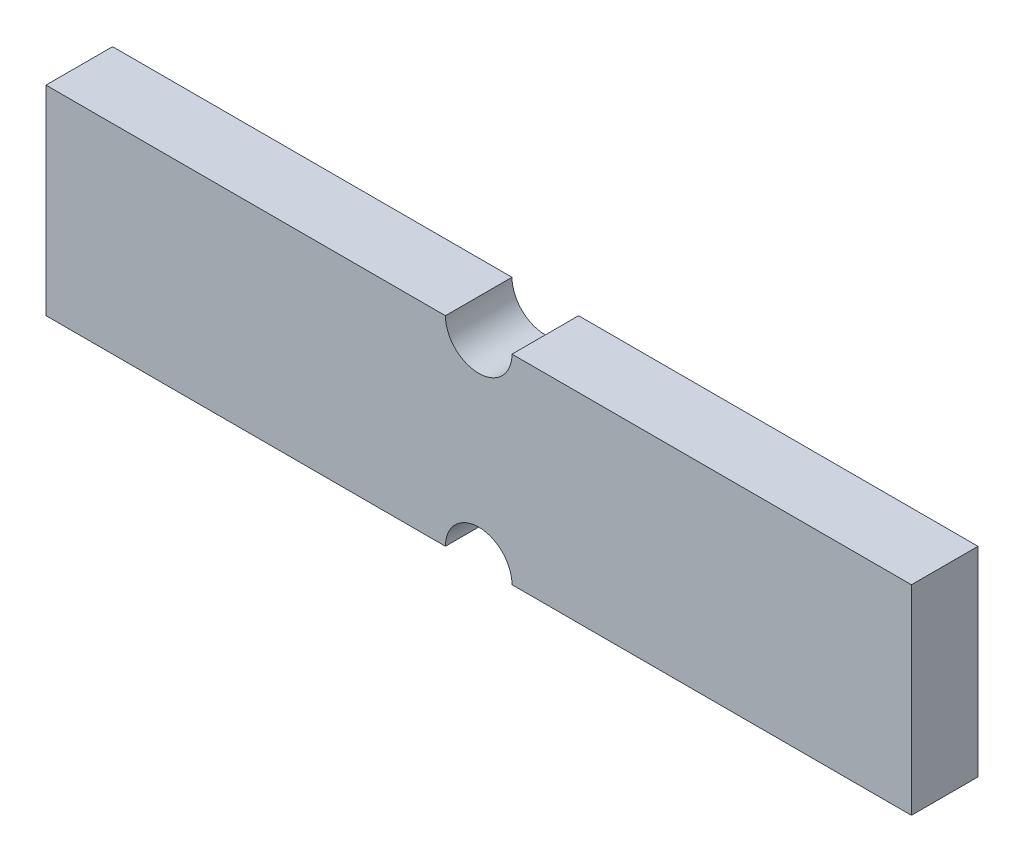
ISO-10303-21;
HEADER;
FILE_DESCRIPTION(('STEP AP214'),'2;1');
FILE_NAME('part.step','',(''),(''),'','','');
FILE_SCHEMA(('AUTOMOTIVE_DESIGN { 1 0 10303 214 1 1 1 1 }'));
ENDSEC;
DATA;
#1=APPLICATION_CONTEXT('core data for automotive mechanical design processes');
#2=APPLICATION_PROTOCOL_DEFINITION('international standard','automotive_design',2000,#1);
#3=PRODUCT_CONTEXT('',#1,'mechanical');
#4=PRODUCT('Part','Part','',(#3));
#5=PRODUCT_RELATED_PRODUCT_CATEGORY('part','',(#4));
#6=PRODUCT_DEFINITION_FORMATION('','',#4);
#7=PRODUCT_DEFINITION_CONTEXT('part definition',#1,'design');
#8=PRODUCT_DEFINITION('design','',#6,#7);
#9=PRODUCT_DEFINITION_SHAPE('','',#8);
#10=(LENGTH_UNIT() NAMED_UNIT(*) SI_UNIT(.MILLI.,.METRE.));
#11=(NAMED_UNIT(*) PLANE_ANGLE_UNIT() SI_UNIT($,.RADIAN.));
#12=(NAMED_UNIT(*) SI_UNIT($,.STERADIAN.) SOLID_ANGLE_UNIT());
#13=UNCERTAINTY_MEASURE_WITH_UNIT(LENGTH_MEASURE(1.E-05),#10,'distance_accuracy_value','');
#14=(GEOMETRIC_REPRESENTATION_CONTEXT(3) GLOBAL_UNCERTAINTY_ASSIGNED_CONTEXT((#13)) GLOBAL_UNIT_ASSIGNED_CONTEXT((#10,
#11,#12)) REPRESENTATION_CONTEXT('',''));
#15=CARTESIAN_POINT('',(0.,0.,0.));
#16=DIRECTION('',(0.,0.,1.));
#17=DIRECTION('',(1.,0.,0.));
#18=AXIS2_PLACEMENT_3D('',#15,#16,#17);
#19=CARTESIAN_POINT('',(0.,0.,12.7));
#20=DIRECTION('',(1.,0.,0.));
#21=DIRECTION('',(0.,0.,-1.));
#22=AXIS2_PLACEMENT_3D('',#19,#20,#21);
#23=PLANE('',#22);
#24=DIRECTION('',(0.,-1.,0.));
#25=VECTOR('',#24,1.);
#26=CARTESIAN_POINT('',(0.,0.,0.));
#27=LINE('',#26,#25);
#28=CARTESIAN_POINT('',(0.,38.1,0.));
#29=VERTEX_POINT('',#28);
#30=CARTESIAN_POINT('',(0.,0.,0.));
#31=VERTEX_POINT('',#30);
#32=EDGE_CURVE('E110',#29,#31,#27,.T.);
#33=ORIENTED_EDGE('',*,*,#32,.T.);
#34=DIRECTION('',(0.,0.,-1.));
#35=VECTOR('',#34,1.);
#36=CARTESIAN_POINT('',(0.,0.,12.7));
#37=LINE('',#36,#35);
#38=CARTESIAN_POINT('',(0.,0.,12.7));
#39=VERTEX_POINT('',#38);
#40=EDGE_CURVE('E12',#39,#31,#37,.T.);
#41=ORIENTED_EDGE('',*,*,#40,.F.);
#42=DIRECTION('',(0.,-1.,0.));
#43=VECTOR('',#42,1.);
#44=CARTESIAN_POINT('',(0.,0.,12.7));
#45=LINE('',#44,#43);
#46=CARTESIAN_POINT('',(0.,38.1,12.7));
#47=VERTEX_POINT('',#46);
#48=EDGE_CURVE('E180',#47,#39,#45,.T.);
#49=ORIENTED_EDGE('',*,*,#48,.F.);
#50=DIRECTION('',(0.,0.,-1.));
#51=VECTOR('',#50,1.);
#52=CARTESIAN_POINT('',(0.,38.1,12.7));
#53=LINE('',#52,#51);
#54=EDGE_CURVE('E123',#47,#29,#53,.T.);
#55=ORIENTED_EDGE('',*,*,#54,.T.);
#56=EDGE_LOOP('',(#33,#41,#49,#55));
#57=FACE_BOUND('',#56,.T.);
#58=ADVANCED_FACE('F42',(#57),#23,.F.);
#59=CARTESIAN_POINT('',(0.,0.,12.7));
#60=DIRECTION('',(0.,1.,0.));
#61=DIRECTION('',(0.,0.,1.));
#62=AXIS2_PLACEMENT_3D('',#59,#60,#61);
#63=PLANE('',#62);
#64=DIRECTION('',(1.,0.,0.));
#65=VECTOR('',#64,1.);
#66=CARTESIAN_POINT('',(0.,0.,0.));
#67=LINE('',#66,#65);
#68=CARTESIAN_POINT('',(76.2,0.,0.));
#69=VERTEX_POINT('',#68);
#70=EDGE_CURVE('E106',#31,#69,#67,.T.);
#71=ORIENTED_EDGE('',*,*,#70,.T.);
#72=DIRECTION('',(0.,0.,-1.));
#73=VECTOR('',#72,1.);
#74=CARTESIAN_POINT('',(76.2,0.,12.7));
#75=LINE('',#74,#73);
#76=CARTESIAN_POINT('',(76.2,0.,12.7));
#77=VERTEX_POINT('',#76);
#78=EDGE_CURVE('E49',#77,#69,#75,.T.);
#79=ORIENTED_EDGE('',*,*,#78,.F.);
#80=DIRECTION('',(1.,0.,0.));
#81=VECTOR('',#80,1.);
#82=CARTESIAN_POINT('',(0.,0.,12.7));
#83=LINE('',#82,#81);
#84=EDGE_CURVE('E119',#39,#77,#83,.T.);
#85=ORIENTED_EDGE('',*,*,#84,.F.);
#86=ORIENTED_EDGE('',*,*,#40,.T.);
#87=EDGE_LOOP('',(#71,#79,#85,#86));
#88=FACE_BOUND('',#87,.T.);
#89=ADVANCED_FACE('F118',(#88),#63,.F.);
#90=CARTESIAN_POINT('',(82.55,0.,12.7));
#91=DIRECTION('',(0.,0.,-1.));
#92=DIRECTION('',(-1.,0.,0.));
#93=AXIS2_PLACEMENT_3D('',#90,#91,#92);
#94=CYLINDRICAL_SURFACE('',#93,6.34999999999999);
#95=CARTESIAN_POINT('',(82.55,0.,0.));
#96=DIRECTION('',(0.,0.,-1.));
#97=DIRECTION('',(1.,0.,0.));
#98=AXIS2_PLACEMENT_3D('',#95,#96,#97);
#99=CIRCLE('',#98,6.34999999999999);
#100=CARTESIAN_POINT('',(88.9,0.,0.));
#101=VERTEX_POINT('',#100);
#102=EDGE_CURVE('E112',#69,#101,#99,.T.);
#103=ORIENTED_EDGE('',*,*,#102,.T.);
#104=DIRECTION('',(0.,0.,-1.));
#105=VECTOR('',#104,1.);
#106=CARTESIAN_POINT('',(88.9,0.,12.7));
#107=LINE('',#106,#105);
#108=CARTESIAN_POINT('',(88.9,0.,12.7));
#109=VERTEX_POINT('',#108);
#110=EDGE_CURVE('E171',#109,#101,#107,.T.);
#111=ORIENTED_EDGE('',*,*,#110,.F.);
#112=CARTESIAN_POINT('',(82.55,0.,12.7));
#113=DIRECTION('',(0.,0.,-1.));
#114=DIRECTION('',(1.,0.,0.));
#115=AXIS2_PLACEMENT_3D('',#112,#113,#114);
#116=CIRCLE('',#115,6.34999999999999);
#117=EDGE_CURVE('E144',#77,#109,#116,.T.);
#118=ORIENTED_EDGE('',*,*,#117,.F.);
#119=ORIENTED_EDGE('',*,*,#78,.T.);
#120=EDGE_LOOP('',(#103,#111,#118,#119));
#121=FACE_BOUND('',#120,.T.);
#122=ADVANCED_FACE('F175',(#121),#94,.F.);
#123=CARTESIAN_POINT('',(88.9,0.,12.7));
#124=DIRECTION('',(0.,1.,0.));
#125=DIRECTION('',(0.,0.,1.));
#126=AXIS2_PLACEMENT_3D('',#123,#124,#125);
#127=PLANE('',#126);
#128=DIRECTION('',(1.,0.,0.));
#129=VECTOR('',#128,1.);
#130=CARTESIAN_POINT('',(88.9,0.,0.));
#131=LINE('',#130,#129);
#132=CARTESIAN_POINT('',(165.1,0.,0.));
#133=VERTEX_POINT('',#132);
#134=EDGE_CURVE('E128',#101,#133,#131,.T.);
#135=ORIENTED_EDGE('',*,*,#134,.T.);
#136=DIRECTION('',(0.,0.,-1.));
#137=VECTOR('',#136,1.);
#138=CARTESIAN_POINT('',(165.1,0.,12.7));
#139=LINE('',#138,#137);
#140=CARTESIAN_POINT('',(165.1,0.,12.7));
#141=VERTEX_POINT('',#140);
#142=EDGE_CURVE('E168',#141,#133,#139,.T.);
#143=ORIENTED_EDGE('',*,*,#142,.F.);
#144=DIRECTION('',(1.,0.,0.));
#145=VECTOR('',#144,1.);
#146=CARTESIAN_POINT('',(88.9,0.,12.7));
#147=LINE('',#146,#145);
#148=EDGE_CURVE('E149',#109,#141,#147,.T.);
#149=ORIENTED_EDGE('',*,*,#148,.F.);
#150=ORIENTED_EDGE('',*,*,#110,.T.);
#151=EDGE_LOOP('',(#135,#143,#149,#150));
#152=FACE_BOUND('',#151,.T.);
#153=ADVANCED_FACE('F197',(#152),#127,.F.);
#154=CARTESIAN_POINT('',(165.1,0.,12.7));
#155=DIRECTION('',(-1.,0.,0.));
#156=DIRECTION('',(0.,0.,1.));
#157=AXIS2_PLACEMENT_3D('',#154,#155,#156);
#158=PLANE('',#157);
#159=DIRECTION('',(0.,1.,0.));
#160=VECTOR('',#159,1.);
#161=CARTESIAN_POINT('',(165.1,0.,0.));
#162=LINE('',#161,#160);
#163=CARTESIAN_POINT('',(165.1,38.1,0.));
#164=VERTEX_POINT('',#163);
#165=EDGE_CURVE('E130',#133,#164,#162,.T.);
#166=ORIENTED_EDGE('',*,*,#165,.T.);
#167=DIRECTION('',(0.,0.,-1.));
#168=VECTOR('',#167,1.);
#169=CARTESIAN_POINT('',(165.1,38.1,12.7));
#170=LINE('',#169,#168);
#171=CARTESIAN_POINT('',(165.1,38.1,12.7));
#172=VERTEX_POINT('',#171);
#173=EDGE_CURVE('E165',#172,#164,#170,.T.);
#174=ORIENTED_EDGE('',*,*,#173,.F.);
#175=DIRECTION('',(0.,1.,0.));
#176=VECTOR('',#175,1.);
#177=CARTESIAN_POINT('',(165.1,0.,12.7));
#178=LINE('',#177,#176);
#179=EDGE_CURVE('E151',#141,#172,#178,.T.);
#180=ORIENTED_EDGE('',*,*,#179,.F.);
#181=ORIENTED_EDGE('',*,*,#142,.T.);
#182=EDGE_LOOP('',(#166,#174,#180,#181));
#183=FACE_BOUND('',#182,.T.);
#184=ADVANCED_FACE('F195',(#183),#158,.F.);
#185=CARTESIAN_POINT('',(88.9,38.1,12.7));
#186=DIRECTION('',(0.,-1.,0.));
#187=DIRECTION('',(0.,0.,-1.));
#188=AXIS2_PLACEMENT_3D('',#185,#186,#187);
#189=PLANE('',#188);
#190=DIRECTION('',(-1.,0.,0.));
#191=VECTOR('',#190,1.);
#192=CARTESIAN_POINT('',(88.9,38.1,0.));
#193=LINE('',#192,#191);
#194=CARTESIAN_POINT('',(88.9,38.1,0.));
#195=VERTEX_POINT('',#194);
#196=EDGE_CURVE('E132',#164,#195,#193,.T.);
#197=ORIENTED_EDGE('',*,*,#196,.T.);
#198=DIRECTION('',(0.,0.,-1.));
#199=VECTOR('',#198,1.);
#200=CARTESIAN_POINT('',(88.9,38.1,12.7));
#201=LINE('',#200,#199);
#202=CARTESIAN_POINT('',(88.9,38.1,12.7));
#203=VERTEX_POINT('',#202);
#204=EDGE_CURVE('E162',#203,#195,#201,.T.);
#205=ORIENTED_EDGE('',*,*,#204,.F.);
#206=DIRECTION('',(-1.,0.,0.));
#207=VECTOR('',#206,1.);
#208=CARTESIAN_POINT('',(88.9,38.1,12.7));
#209=LINE('',#208,#207);
#210=EDGE_CURVE('E153',#172,#203,#209,.T.);
#211=ORIENTED_EDGE('',*,*,#210,.F.);
#212=ORIENTED_EDGE('',*,*,#173,.T.);
#213=EDGE_LOOP('',(#197,#205,#211,#212));
#214=FACE_BOUND('',#213,.T.);
#215=ADVANCED_FACE('F191',(#214),#189,.F.);
#216=CARTESIAN_POINT('',(82.55,38.1,12.7));
#217=DIRECTION('',(0.,0.,-1.));
#218=DIRECTION('',(-1.,0.,0.));
#219=AXIS2_PLACEMENT_3D('',#216,#217,#218);
#220=CYLINDRICAL_SURFACE('',#219,6.34999999999999);
#221=CARTESIAN_POINT('',(82.55,38.1,0.));
#222=DIRECTION('',(0.,0.,-1.));
#223=DIRECTION('',(1.,0.,0.));
#224=AXIS2_PLACEMENT_3D('',#221,#222,#223);
#225=CIRCLE('',#224,6.34999999999999);
#226=CARTESIAN_POINT('',(76.2,38.1,0.));
#227=VERTEX_POINT('',#226);
#228=EDGE_CURVE('E134',#195,#227,#225,.T.);
#229=ORIENTED_EDGE('',*,*,#228,.T.);
#230=DIRECTION('',(0.,0.,-1.));
#231=VECTOR('',#230,1.);
#232=CARTESIAN_POINT('',(76.2,38.1,12.7));
#233=LINE('',#232,#231);
#234=CARTESIAN_POINT('',(76.2,38.1,12.7));
#235=VERTEX_POINT('',#234);
#236=EDGE_CURVE('E159',#235,#227,#233,.T.);
#237=ORIENTED_EDGE('',*,*,#236,.F.);
#238=CARTESIAN_POINT('',(82.55,38.1,12.7));
#239=DIRECTION('',(0.,0.,-1.));
#240=DIRECTION('',(1.,0.,0.));
#241=AXIS2_PLACEMENT_3D('',#238,#239,#240);
#242=CIRCLE('',#241,6.34999999999999);
#243=EDGE_CURVE('E61',#203,#235,#242,.T.);
#244=ORIENTED_EDGE('',*,*,#243,.F.);
#245=ORIENTED_EDGE('',*,*,#204,.T.);
#246=EDGE_LOOP('',(#229,#237,#244,#245));
#247=FACE_BOUND('',#246,.T.);
#248=ADVANCED_FACE('F187',(#247),#220,.F.);
#249=CARTESIAN_POINT('',(0.,38.1,12.7));
#250=DIRECTION('',(0.,-1.,0.));
#251=DIRECTION('',(0.,0.,-1.));
#252=AXIS2_PLACEMENT_3D('',#249,#250,#251);
#253=PLANE('',#252);
#254=DIRECTION('',(-1.,0.,0.));
#255=VECTOR('',#254,1.);
#256=CARTESIAN_POINT('',(0.,38.1,0.));
#257=LINE('',#256,#255);
#258=EDGE_CURVE('E138',#227,#29,#257,.T.);
#259=ORIENTED_EDGE('',*,*,#258,.T.);
#260=ORIENTED_EDGE('',*,*,#54,.F.);
#261=DIRECTION('',(-1.,0.,0.));
#262=VECTOR('',#261,1.);
#263=CARTESIAN_POINT('',(0.,38.1,12.7));
#264=LINE('',#263,#262);
#265=EDGE_CURVE('E56',#235,#47,#264,.T.);
#266=ORIENTED_EDGE('',*,*,#265,.F.);
#267=ORIENTED_EDGE('',*,*,#236,.T.);
#268=EDGE_LOOP('',(#259,#260,#266,#267));
#269=FACE_BOUND('',#268,.T.);
#270=ADVANCED_FACE('F182',(#269),#253,.F.);
#271=CARTESIAN_POINT('',(82.55,38.1,12.7));
#272=DIRECTION('',(0.,0.,1.));
#273=DIRECTION('',(1.,0.,0.));
#274=AXIS2_PLACEMENT_3D('',#271,#272,#273);
#275=PLANE('',#274);
#276=ORIENTED_EDGE('',*,*,#48,.T.);
#277=ORIENTED_EDGE('',*,*,#84,.T.);
#278=ORIENTED_EDGE('',*,*,#117,.T.);
#279=ORIENTED_EDGE('',*,*,#148,.T.);
#280=ORIENTED_EDGE('',*,*,#179,.T.);
#281=ORIENTED_EDGE('',*,*,#210,.T.);
#282=ORIENTED_EDGE('',*,*,#243,.T.);
#283=ORIENTED_EDGE('',*,*,#265,.T.);
#284=EDGE_LOOP('',(#276,#277,#278,#279,#280,#281,#282,#283));
#285=FACE_BOUND('',#284,.T.);
#286=ADVANCED_FACE('F178',(#285),#275,.T.);
#287=CARTESIAN_POINT('',(82.55,38.1,0.));
#288=DIRECTION('',(0.,0.,1.));
#289=DIRECTION('',(1.,0.,0.));
#290=AXIS2_PLACEMENT_3D('',#287,#288,#289);
#291=PLANE('',#290);
#292=ORIENTED_EDGE('',*,*,#32,.F.);
#293=ORIENTED_EDGE('',*,*,#258,.F.);
#294=ORIENTED_EDGE('',*,*,#228,.F.);
#295=ORIENTED_EDGE('',*,*,#196,.F.);
#296=ORIENTED_EDGE('',*,*,#165,.F.);
#297=ORIENTED_EDGE('',*,*,#134,.F.);
#298=ORIENTED_EDGE('',*,*,#102,.F.);
#299=ORIENTED_EDGE('',*,*,#70,.F.);
#300=EDGE_LOOP('',(#292,#293,#294,#295,#296,#297,#298,#299));
#301=FACE_BOUND('',#300,.T.);
#302=ADVANCED_FACE('F107',(#301),#291,.F.);
#303=CLOSED_SHELL('',(#58,#89,#122,#153,#184,#215,#248,#270,#286,#302));
#304=MANIFOLD_SOLID_BREP('B2',#303);
#305=ADVANCED_BREP_SHAPE_REPRESENTATION('',(#18,#304),#14);
#306=SHAPE_DEFINITION_REPRESENTATION(#9,#305);
ENDSEC;
END-ISO-10303-21;
